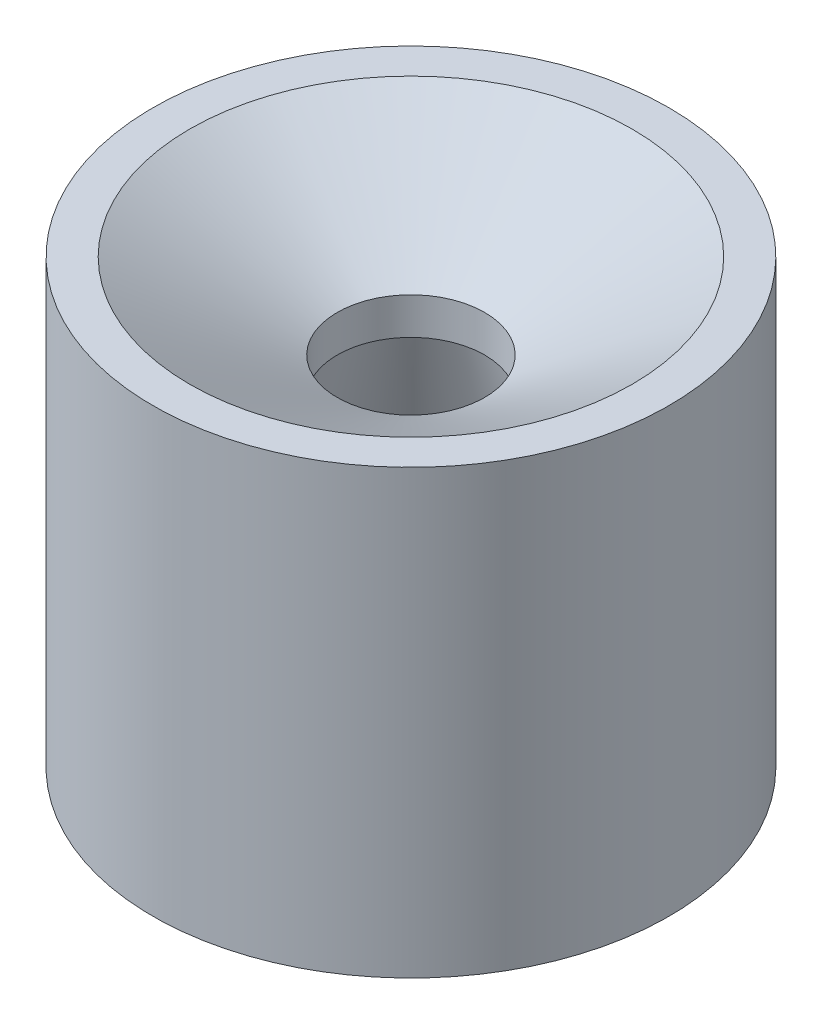
ISO-10303-21;
HEADER;
FILE_DESCRIPTION(('STEP AP214'),'2;1');
FILE_NAME('part.step','',(''),(''),'','','');
FILE_SCHEMA(('AUTOMOTIVE_DESIGN { 1 0 10303 214 1 1 1 1 }'));
ENDSEC;
DATA;
#1=APPLICATION_CONTEXT('core data for automotive mechanical design processes');
#2=APPLICATION_PROTOCOL_DEFINITION('international standard','automotive_design',2000,#1);
#3=PRODUCT_CONTEXT('',#1,'mechanical');
#4=PRODUCT('Part','Part','',(#3));
#5=PRODUCT_RELATED_PRODUCT_CATEGORY('part','',(#4));
#6=PRODUCT_DEFINITION_FORMATION('','',#4);
#7=PRODUCT_DEFINITION_CONTEXT('part definition',#1,'design');
#8=PRODUCT_DEFINITION('design','',#6,#7);
#9=PRODUCT_DEFINITION_SHAPE('','',#8);
#10=(LENGTH_UNIT() NAMED_UNIT(*) SI_UNIT(.MILLI.,.METRE.));
#11=(NAMED_UNIT(*) PLANE_ANGLE_UNIT() SI_UNIT($,.RADIAN.));
#12=(NAMED_UNIT(*) SI_UNIT($,.STERADIAN.) SOLID_ANGLE_UNIT());
#13=UNCERTAINTY_MEASURE_WITH_UNIT(LENGTH_MEASURE(1.E-05),#10,'distance_accuracy_value','');
#14=(GEOMETRIC_REPRESENTATION_CONTEXT(3) GLOBAL_UNCERTAINTY_ASSIGNED_CONTEXT((#13)) GLOBAL_UNIT_ASSIGNED_CONTEXT((#10,
#11,#12)) REPRESENTATION_CONTEXT('',''));
#15=CARTESIAN_POINT('',(0.,0.,0.));
#16=DIRECTION('',(0.,0.,1.));
#17=DIRECTION('',(1.,0.,0.));
#18=AXIS2_PLACEMENT_3D('',#15,#16,#17);
#19=CARTESIAN_POINT('',(-28.321,0.,0.));
#20=DIRECTION('',(0.,1.,0.));
#21=DIRECTION('',(0.,0.,1.));
#22=AXIS2_PLACEMENT_3D('',#19,#20,#21);
#23=PLANE('',#22);
#24=CARTESIAN_POINT('',(0.,0.,0.));
#25=DIRECTION('',(0.,-1.,0.));
#26=DIRECTION('',(0.,0.,-1.));
#27=AXIS2_PLACEMENT_3D('',#24,#25,#26);
#28=CIRCLE('',#27,28.321);
#29=CARTESIAN_POINT('',(0.,0.,-28.321));
#30=VERTEX_POINT('',#29);
#31=EDGE_CURVE('E64',#30,#30,#28,.T.);
#32=ORIENTED_EDGE('',*,*,#31,.F.);
#33=EDGE_LOOP('',(#32));
#34=FACE_BOUND('',#33,.T.);
#35=CARTESIAN_POINT('',(0.,0.,0.));
#36=DIRECTION('',(0.,-1.,0.));
#37=DIRECTION('',(0.,0.,-1.));
#38=AXIS2_PLACEMENT_3D('',#35,#36,#37);
#39=CIRCLE('',#38,44.45);
#40=CARTESIAN_POINT('',(0.,0.,-44.45));
#41=VERTEX_POINT('',#40);
#42=EDGE_CURVE('E10',#41,#41,#39,.T.);
#43=ORIENTED_EDGE('',*,*,#42,.T.);
#44=EDGE_LOOP('',(#43));
#45=FACE_BOUND('',#44,.T.);
#46=ADVANCED_FACE('F37',(#34,#45),#23,.F.);
#47=CARTESIAN_POINT('',(0.,0.,0.));
#48=DIRECTION('',(0.,-1.,0.));
#49=DIRECTION('',(0.,0.,-1.));
#50=AXIS2_PLACEMENT_3D('',#47,#48,#49);
#51=CYLINDRICAL_SURFACE('',#50,44.45);
#52=ORIENTED_EDGE('',*,*,#42,.F.);
#53=EDGE_LOOP('',(#52));
#54=FACE_BOUND('',#53,.T.);
#55=CARTESIAN_POINT('',(0.,76.2,0.));
#56=DIRECTION('',(0.,-1.,0.));
#57=DIRECTION('',(0.,0.,-1.));
#58=AXIS2_PLACEMENT_3D('',#55,#56,#57);
#59=CIRCLE('',#58,44.45);
#60=CARTESIAN_POINT('',(0.,76.2,-44.45));
#61=VERTEX_POINT('',#60);
#62=EDGE_CURVE('E44',#61,#61,#59,.T.);
#63=ORIENTED_EDGE('',*,*,#62,.T.);
#64=EDGE_LOOP('',(#63));
#65=FACE_BOUND('',#64,.T.);
#66=ADVANCED_FACE('F72',(#54,#65),#51,.T.);
#67=CARTESIAN_POINT('',(-44.45,76.2,0.));
#68=DIRECTION('',(0.,-1.,0.));
#69=DIRECTION('',(0.,0.,-1.));
#70=AXIS2_PLACEMENT_3D('',#67,#68,#69);
#71=PLANE('',#70);
#72=ORIENTED_EDGE('',*,*,#62,.F.);
#73=EDGE_LOOP('',(#72));
#74=FACE_BOUND('',#73,.T.);
#75=CARTESIAN_POINT('',(0.,76.2,0.));
#76=DIRECTION('',(0.,-1.,0.));
#77=DIRECTION('',(0.,0.,-1.));
#78=AXIS2_PLACEMENT_3D('',#75,#76,#77);
#79=CIRCLE('',#78,38.1);
#80=CARTESIAN_POINT('',(0.,76.2,-38.1));
#81=VERTEX_POINT('',#80);
#82=EDGE_CURVE('E49',#81,#81,#79,.T.);
#83=ORIENTED_EDGE('',*,*,#82,.T.);
#84=EDGE_LOOP('',(#83));
#85=FACE_BOUND('',#84,.T.);
#86=ADVANCED_FACE('F76',(#74,#85),#71,.F.);
#87=CARTESIAN_POINT('',(0.,61.5353031625835,0.));
#88=DIRECTION('',(0.,1.,0.));
#89=DIRECTION('',(0.,0.,1.));
#90=AXIS2_PLACEMENT_3D('',#87,#88,#89);
#91=CONICAL_SURFACE('',#90,12.7,1.0471975511966);
#92=ORIENTED_EDGE('',*,*,#82,.F.);
#93=EDGE_LOOP('',(#92));
#94=FACE_BOUND('',#93,.T.);
#95=CARTESIAN_POINT('',(0.,61.5353031625835,0.));
#96=DIRECTION('',(0.,-1.,0.));
#97=DIRECTION('',(0.,0.,-1.));
#98=AXIS2_PLACEMENT_3D('',#95,#96,#97);
#99=CIRCLE('',#98,12.7);
#100=CARTESIAN_POINT('',(0.,61.5353031625835,-12.7));
#101=VERTEX_POINT('',#100);
#102=EDGE_CURVE('E54',#101,#101,#99,.T.);
#103=ORIENTED_EDGE('',*,*,#102,.T.);
#104=EDGE_LOOP('',(#103));
#105=FACE_BOUND('',#104,.T.);
#106=ADVANCED_FACE('F81',(#94,#105),#91,.F.);
#107=CARTESIAN_POINT('',(0.,0.,0.));
#108=DIRECTION('',(0.,-1.,0.));
#109=DIRECTION('',(0.,0.,-1.));
#110=AXIS2_PLACEMENT_3D('',#107,#108,#109);
#111=CYLINDRICAL_SURFACE('',#110,12.7);
#112=ORIENTED_EDGE('',*,*,#102,.F.);
#113=EDGE_LOOP('',(#112));
#114=FACE_BOUND('',#113,.T.);
#115=CARTESIAN_POINT('',(0.,55.1853031625835,0.));
#116=DIRECTION('',(0.,-1.,0.));
#117=DIRECTION('',(0.,0.,-1.));
#118=AXIS2_PLACEMENT_3D('',#115,#116,#117);
#119=CIRCLE('',#118,12.7);
#120=CARTESIAN_POINT('',(0.,55.1853031625835,-12.7));
#121=VERTEX_POINT('',#120);
#122=EDGE_CURVE('E60',#121,#121,#119,.T.);
#123=ORIENTED_EDGE('',*,*,#122,.T.);
#124=EDGE_LOOP('',(#123));
#125=FACE_BOUND('',#124,.T.);
#126=ADVANCED_FACE('F87',(#114,#125),#111,.F.);
#127=CARTESIAN_POINT('',(0.,0.,0.));
#128=DIRECTION('',(0.,-1.,0.));
#129=DIRECTION('',(0.,0.,-1.));
#130=AXIS2_PLACEMENT_3D('',#127,#128,#129);
#131=CONICAL_SURFACE('',#130,28.321,0.27584814196086);
#132=ORIENTED_EDGE('',*,*,#122,.F.);
#133=EDGE_LOOP('',(#132));
#134=FACE_BOUND('',#133,.T.);
#135=ORIENTED_EDGE('',*,*,#31,.T.);
#136=EDGE_LOOP('',(#135));
#137=FACE_BOUND('',#136,.T.);
#138=ADVANCED_FACE('F69',(#134,#137),#131,.F.);
#139=CLOSED_SHELL('',(#46,#66,#86,#106,#126,#138));
#140=MANIFOLD_SOLID_BREP('B2',#139);
#141=ADVANCED_BREP_SHAPE_REPRESENTATION('',(#18,#140),#14);
#142=SHAPE_DEFINITION_REPRESENTATION(#9,#141);
ENDSEC;
END-ISO-10303-21;
